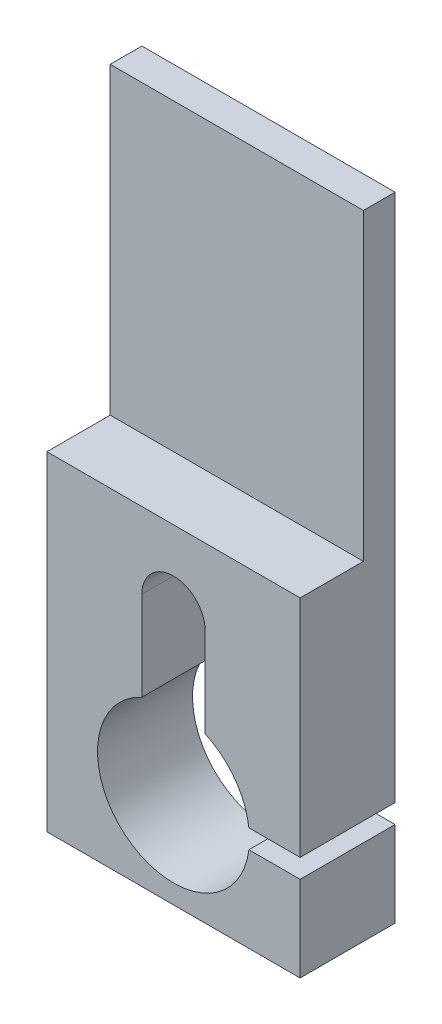
ISO-10303-21;
HEADER;
FILE_DESCRIPTION(('STEP AP214'),'2;1');
FILE_NAME('part.step','',(''),(''),'','','');
FILE_SCHEMA(('AUTOMOTIVE_DESIGN { 1 0 10303 214 1 1 1 1 }'));
ENDSEC;
DATA;
#1=APPLICATION_CONTEXT('core data for automotive mechanical design processes');
#2=APPLICATION_PROTOCOL_DEFINITION('international standard','automotive_design',2000,#1);
#3=PRODUCT_CONTEXT('',#1,'mechanical');
#4=PRODUCT('Part','Part','',(#3));
#5=PRODUCT_RELATED_PRODUCT_CATEGORY('part','',(#4));
#6=PRODUCT_DEFINITION_FORMATION('','',#4);
#7=PRODUCT_DEFINITION_CONTEXT('part definition',#1,'design');
#8=PRODUCT_DEFINITION('design','',#6,#7);
#9=PRODUCT_DEFINITION_SHAPE('','',#8);
#10=(LENGTH_UNIT() NAMED_UNIT(*) SI_UNIT(.MILLI.,.METRE.));
#11=(NAMED_UNIT(*) PLANE_ANGLE_UNIT() SI_UNIT($,.RADIAN.));
#12=(NAMED_UNIT(*) SI_UNIT($,.STERADIAN.) SOLID_ANGLE_UNIT());
#13=UNCERTAINTY_MEASURE_WITH_UNIT(LENGTH_MEASURE(1.E-05),#10,'distance_accuracy_value','');
#14=(GEOMETRIC_REPRESENTATION_CONTEXT(3) GLOBAL_UNCERTAINTY_ASSIGNED_CONTEXT((#13)) GLOBAL_UNIT_ASSIGNED_CONTEXT((#10,
#11,#12)) REPRESENTATION_CONTEXT('',''));
#15=CARTESIAN_POINT('',(0.,0.,0.));
#16=DIRECTION('',(0.,0.,1.));
#17=DIRECTION('',(1.,0.,0.));
#18=AXIS2_PLACEMENT_3D('',#15,#16,#17);
#19=CARTESIAN_POINT('',(0.,0.,15.));
#20=DIRECTION('',(-1.,0.,0.));
#21=DIRECTION('',(0.,0.,1.));
#22=AXIS2_PLACEMENT_3D('',#19,#20,#21);
#23=PLANE('',#22);
#24=DIRECTION('',(0.,1.,0.));
#25=VECTOR('',#24,1.);
#26=CARTESIAN_POINT('',(0.,0.,0.));
#27=LINE('',#26,#25);
#28=CARTESIAN_POINT('',(0.,0.,0.));
#29=VERTEX_POINT('',#28);
#30=CARTESIAN_POINT('',(0.,13.5,0.));
#31=VERTEX_POINT('',#30);
#32=EDGE_CURVE('E164',#29,#31,#27,.T.);
#33=ORIENTED_EDGE('',*,*,#32,.T.);
#34=DIRECTION('',(0.,0.,-1.));
#35=VECTOR('',#34,1.);
#36=CARTESIAN_POINT('',(0.,13.5,15.));
#37=LINE('',#36,#35);
#38=CARTESIAN_POINT('',(0.,13.5,15.));
#39=VERTEX_POINT('',#38);
#40=EDGE_CURVE('E11',#39,#31,#37,.T.);
#41=ORIENTED_EDGE('',*,*,#40,.F.);
#42=DIRECTION('',(0.,1.,0.));
#43=VECTOR('',#42,1.);
#44=CARTESIAN_POINT('',(0.,0.,15.));
#45=LINE('',#44,#43);
#46=CARTESIAN_POINT('',(0.,0.,15.));
#47=VERTEX_POINT('',#46);
#48=EDGE_CURVE('E188',#47,#39,#45,.T.);
#49=ORIENTED_EDGE('',*,*,#48,.F.);
#50=DIRECTION('',(0.,0.,-1.));
#51=VECTOR('',#50,1.);
#52=CARTESIAN_POINT('',(0.,0.,15.));
#53=LINE('',#52,#51);
#54=EDGE_CURVE('E163',#47,#29,#53,.T.);
#55=ORIENTED_EDGE('',*,*,#54,.T.);
#56=EDGE_LOOP('',(#33,#41,#49,#55));
#57=FACE_BOUND('',#56,.T.);
#58=ADVANCED_FACE('F31',(#57),#23,.F.);
#59=CARTESIAN_POINT('',(-8.09411910020934,13.5,15.));
#60=DIRECTION('',(0.,-1.,0.));
#61=DIRECTION('',(0.,0.,-1.));
#62=AXIS2_PLACEMENT_3D('',#59,#60,#61);
#63=PLANE('',#62);
#64=DIRECTION('',(-1.,0.,0.));
#65=VECTOR('',#64,1.);
#66=CARTESIAN_POINT('',(-8.09411910020934,13.5,0.));
#67=LINE('',#66,#65);
#68=CARTESIAN_POINT('',(-8.09411910020934,13.5,0.));
#69=VERTEX_POINT('',#68);
#70=EDGE_CURVE('E167',#31,#69,#67,.T.);
#71=ORIENTED_EDGE('',*,*,#70,.T.);
#72=DIRECTION('',(0.,0.,-1.));
#73=VECTOR('',#72,1.);
#74=CARTESIAN_POINT('',(-8.09411910020934,13.5,15.));
#75=LINE('',#74,#73);
#76=CARTESIAN_POINT('',(-8.09411910020934,13.5,15.));
#77=VERTEX_POINT('',#76);
#78=EDGE_CURVE('E38',#77,#69,#75,.T.);
#79=ORIENTED_EDGE('',*,*,#78,.F.);
#80=DIRECTION('',(-1.,0.,0.));
#81=VECTOR('',#80,1.);
#82=CARTESIAN_POINT('',(-8.09411910020934,13.5,15.));
#83=LINE('',#82,#81);
#84=EDGE_CURVE('E107',#39,#77,#83,.T.);
#85=ORIENTED_EDGE('',*,*,#84,.F.);
#86=ORIENTED_EDGE('',*,*,#40,.T.);
#87=EDGE_LOOP('',(#71,#79,#85,#86));
#88=FACE_BOUND('',#87,.T.);
#89=ADVANCED_FACE('F279',(#88),#63,.F.);
#90=CARTESIAN_POINT('',(-20.,15.,15.));
#91=DIRECTION('',(0.,0.,-1.));
#92=DIRECTION('',(-1.,0.,0.));
#93=AXIS2_PLACEMENT_3D('',#90,#91,#92);
#94=CYLINDRICAL_SURFACE('',#93,12.);
#95=CARTESIAN_POINT('',(-20.,15.,0.));
#96=DIRECTION('',(0.,0.,-1.));
#97=DIRECTION('',(1.,0.,0.));
#98=AXIS2_PLACEMENT_3D('',#95,#96,#97);
#99=CIRCLE('',#98,12.);
#100=CARTESIAN_POINT('',(-25.,25.9087121146357,0.));
#101=VERTEX_POINT('',#100);
#102=EDGE_CURVE('E169',#69,#101,#99,.T.);
#103=ORIENTED_EDGE('',*,*,#102,.T.);
#104=DIRECTION('',(0.,0.,-1.));
#105=VECTOR('',#104,1.);
#106=CARTESIAN_POINT('',(-25.,25.9087121146357,15.));
#107=LINE('',#106,#105);
#108=CARTESIAN_POINT('',(-25.,25.9087121146357,15.));
#109=VERTEX_POINT('',#108);
#110=EDGE_CURVE('E205',#109,#101,#107,.T.);
#111=ORIENTED_EDGE('',*,*,#110,.F.);
#112=CARTESIAN_POINT('',(-20.,15.,15.));
#113=DIRECTION('',(0.,0.,-1.));
#114=DIRECTION('',(1.,0.,0.));
#115=AXIS2_PLACEMENT_3D('',#112,#113,#114);
#116=CIRCLE('',#115,12.);
#117=EDGE_CURVE('E213',#77,#109,#116,.T.);
#118=ORIENTED_EDGE('',*,*,#117,.F.);
#119=ORIENTED_EDGE('',*,*,#78,.T.);
#120=EDGE_LOOP('',(#103,#111,#118,#119));
#121=FACE_BOUND('',#120,.T.);
#122=ADVANCED_FACE('F211',(#121),#94,.F.);
#123=CARTESIAN_POINT('',(-25.,25.9087121146357,15.));
#124=DIRECTION('',(-1.,0.,0.));
#125=DIRECTION('',(0.,0.,1.));
#126=AXIS2_PLACEMENT_3D('',#123,#124,#125);
#127=PLANE('',#126);
#128=DIRECTION('',(0.,1.,0.));
#129=VECTOR('',#128,1.);
#130=CARTESIAN_POINT('',(-25.,25.9087121146357,0.));
#131=LINE('',#130,#129);
#132=CARTESIAN_POINT('',(-25.,40.,0.));
#133=VERTEX_POINT('',#132);
#134=EDGE_CURVE('E171',#101,#133,#131,.T.);
#135=ORIENTED_EDGE('',*,*,#134,.T.);
#136=DIRECTION('',(0.,0.,-1.));
#137=VECTOR('',#136,1.);
#138=CARTESIAN_POINT('',(-25.,40.,15.));
#139=LINE('',#138,#137);
#140=CARTESIAN_POINT('',(-25.,40.,15.));
#141=VERTEX_POINT('',#140);
#142=EDGE_CURVE('E202',#141,#133,#139,.T.);
#143=ORIENTED_EDGE('',*,*,#142,.F.);
#144=DIRECTION('',(0.,1.,0.));
#145=VECTOR('',#144,1.);
#146=CARTESIAN_POINT('',(-25.,25.9087121146357,15.));
#147=LINE('',#146,#145);
#148=EDGE_CURVE('E231',#109,#141,#147,.T.);
#149=ORIENTED_EDGE('',*,*,#148,.F.);
#150=ORIENTED_EDGE('',*,*,#110,.T.);
#151=EDGE_LOOP('',(#135,#143,#149,#150));
#152=FACE_BOUND('',#151,.T.);
#153=ADVANCED_FACE('F222',(#152),#127,.F.);
#154=CARTESIAN_POINT('',(-20.,40.,15.));
#155=DIRECTION('',(0.,0.,-1.));
#156=DIRECTION('',(-1.,0.,0.));
#157=AXIS2_PLACEMENT_3D('',#154,#155,#156);
#158=CYLINDRICAL_SURFACE('',#157,5.);
#159=CARTESIAN_POINT('',(-20.,40.,0.));
#160=DIRECTION('',(0.,0.,-1.));
#161=DIRECTION('',(1.,0.,0.));
#162=AXIS2_PLACEMENT_3D('',#159,#160,#161);
#163=CIRCLE('',#162,5.);
#164=CARTESIAN_POINT('',(-15.,40.,0.));
#165=VERTEX_POINT('',#164);
#166=EDGE_CURVE('E173',#133,#165,#163,.T.);
#167=ORIENTED_EDGE('',*,*,#166,.T.);
#168=DIRECTION('',(0.,0.,-1.));
#169=VECTOR('',#168,1.);
#170=CARTESIAN_POINT('',(-15.,40.,15.));
#171=LINE('',#170,#169);
#172=CARTESIAN_POINT('',(-15.,40.,15.));
#173=VERTEX_POINT('',#172);
#174=EDGE_CURVE('E199',#173,#165,#171,.T.);
#175=ORIENTED_EDGE('',*,*,#174,.F.);
#176=CARTESIAN_POINT('',(-20.,40.,15.));
#177=DIRECTION('',(0.,0.,-1.));
#178=DIRECTION('',(1.,0.,0.));
#179=AXIS2_PLACEMENT_3D('',#176,#177,#178);
#180=CIRCLE('',#179,5.);
#181=EDGE_CURVE('E228',#141,#173,#180,.T.);
#182=ORIENTED_EDGE('',*,*,#181,.F.);
#183=ORIENTED_EDGE('',*,*,#142,.T.);
#184=EDGE_LOOP('',(#167,#175,#182,#183));
#185=FACE_BOUND('',#184,.T.);
#186=ADVANCED_FACE('F226',(#185),#158,.F.);
#187=CARTESIAN_POINT('',(-15.,25.9087121146357,15.));
#188=DIRECTION('',(1.,0.,0.));
#189=DIRECTION('',(0.,0.,-1.));
#190=AXIS2_PLACEMENT_3D('',#187,#188,#189);
#191=PLANE('',#190);
#192=DIRECTION('',(0.,-1.,0.));
#193=VECTOR('',#192,1.);
#194=CARTESIAN_POINT('',(-15.,25.9087121146357,0.));
#195=LINE('',#194,#193);
#196=CARTESIAN_POINT('',(-15.,25.9087121146357,0.));
#197=VERTEX_POINT('',#196);
#198=EDGE_CURVE('E175',#165,#197,#195,.T.);
#199=ORIENTED_EDGE('',*,*,#198,.T.);
#200=DIRECTION('',(0.,0.,-1.));
#201=VECTOR('',#200,1.);
#202=CARTESIAN_POINT('',(-15.,25.9087121146357,15.));
#203=LINE('',#202,#201);
#204=CARTESIAN_POINT('',(-15.,25.9087121146357,15.));
#205=VERTEX_POINT('',#204);
#206=EDGE_CURVE('E196',#205,#197,#203,.T.);
#207=ORIENTED_EDGE('',*,*,#206,.F.);
#208=DIRECTION('',(0.,-1.,0.));
#209=VECTOR('',#208,1.);
#210=CARTESIAN_POINT('',(-15.,25.9087121146357,15.));
#211=LINE('',#210,#209);
#212=EDGE_CURVE('E230',#173,#205,#211,.T.);
#213=ORIENTED_EDGE('',*,*,#212,.F.);
#214=ORIENTED_EDGE('',*,*,#174,.T.);
#215=EDGE_LOOP('',(#199,#207,#213,#214));
#216=FACE_BOUND('',#215,.T.);
#217=ADVANCED_FACE('F291',(#216),#191,.F.);
#218=CARTESIAN_POINT('',(-20.,15.,15.));
#219=DIRECTION('',(0.,0.,-1.));
#220=DIRECTION('',(-1.,0.,0.));
#221=AXIS2_PLACEMENT_3D('',#218,#219,#220);
#222=CYLINDRICAL_SURFACE('',#221,12.);
#223=CARTESIAN_POINT('',(-20.,15.,0.));
#224=DIRECTION('',(0.,0.,-1.));
#225=DIRECTION('',(1.,0.,0.));
#226=AXIS2_PLACEMENT_3D('',#223,#224,#225);
#227=CIRCLE('',#226,12.);
#228=CARTESIAN_POINT('',(-8.09411910020934,16.5,0.));
#229=VERTEX_POINT('',#228);
#230=EDGE_CURVE('E177',#197,#229,#227,.T.);
#231=ORIENTED_EDGE('',*,*,#230,.T.);
#232=DIRECTION('',(0.,0.,-1.));
#233=VECTOR('',#232,1.);
#234=CARTESIAN_POINT('',(-8.09411910020934,16.5,15.));
#235=LINE('',#234,#233);
#236=CARTESIAN_POINT('',(-8.09411910020934,16.5,15.));
#237=VERTEX_POINT('',#236);
#238=EDGE_CURVE('E149',#237,#229,#235,.T.);
#239=ORIENTED_EDGE('',*,*,#238,.F.);
#240=CARTESIAN_POINT('',(-20.,15.,15.));
#241=DIRECTION('',(0.,0.,-1.));
#242=DIRECTION('',(1.,0.,0.));
#243=AXIS2_PLACEMENT_3D('',#240,#241,#242);
#244=CIRCLE('',#243,12.);
#245=EDGE_CURVE('E136',#205,#237,#244,.T.);
#246=ORIENTED_EDGE('',*,*,#245,.F.);
#247=ORIENTED_EDGE('',*,*,#206,.T.);
#248=EDGE_LOOP('',(#231,#239,#246,#247));
#249=FACE_BOUND('',#248,.T.);
#250=ADVANCED_FACE('F294',(#249),#222,.F.);
#251=CARTESIAN_POINT('',(-8.09411910020934,16.5,15.));
#252=DIRECTION('',(0.,1.,0.));
#253=DIRECTION('',(0.,0.,1.));
#254=AXIS2_PLACEMENT_3D('',#251,#252,#253);
#255=PLANE('',#254);
#256=DIRECTION('',(1.,0.,0.));
#257=VECTOR('',#256,1.);
#258=CARTESIAN_POINT('',(-8.09411910020934,16.5,0.));
#259=LINE('',#258,#257);
#260=CARTESIAN_POINT('',(0.,16.5,0.));
#261=VERTEX_POINT('',#260);
#262=EDGE_CURVE('E145',#229,#261,#259,.T.);
#263=ORIENTED_EDGE('',*,*,#262,.T.);
#264=DIRECTION('',(0.,0.,-1.));
#265=VECTOR('',#264,1.);
#266=CARTESIAN_POINT('',(0.,16.5,15.));
#267=LINE('',#266,#265);
#268=CARTESIAN_POINT('',(0.,16.5,15.));
#269=VERTEX_POINT('',#268);
#270=EDGE_CURVE('E142',#269,#261,#267,.T.);
#271=ORIENTED_EDGE('',*,*,#270,.F.);
#272=DIRECTION('',(1.,0.,0.));
#273=VECTOR('',#272,1.);
#274=CARTESIAN_POINT('',(-8.09411910020934,16.5,15.));
#275=LINE('',#274,#273);
#276=EDGE_CURVE('E130',#237,#269,#275,.T.);
#277=ORIENTED_EDGE('',*,*,#276,.F.);
#278=ORIENTED_EDGE('',*,*,#238,.T.);
#279=EDGE_LOOP('',(#263,#271,#277,#278));
#280=FACE_BOUND('',#279,.T.);
#281=ADVANCED_FACE('F143',(#280),#255,.F.);
#282=CARTESIAN_POINT('',(0.,16.5,15.));
#283=DIRECTION('',(-1.,0.,0.));
#284=DIRECTION('',(0.,0.,1.));
#285=AXIS2_PLACEMENT_3D('',#282,#283,#284);
#286=PLANE('',#285);
#287=DIRECTION('',(0.,1.,0.));
#288=VECTOR('',#287,1.);
#289=CARTESIAN_POINT('',(0.,100.,5.));
#290=LINE('',#289,#288);
#291=CARTESIAN_POINT('',(0.,52.,5.));
#292=VERTEX_POINT('',#291);
#293=CARTESIAN_POINT('',(0.,100.,5.));
#294=VERTEX_POINT('',#293);
#295=EDGE_CURVE('E247',#292,#294,#290,.T.);
#296=ORIENTED_EDGE('',*,*,#295,.F.);
#297=DIRECTION('',(0.,0.,1.));
#298=VECTOR('',#297,1.);
#299=CARTESIAN_POINT('',(0.,52.,5.));
#300=LINE('',#299,#298);
#301=CARTESIAN_POINT('',(0.,52.,15.));
#302=VERTEX_POINT('',#301);
#303=EDGE_CURVE('E156',#292,#302,#300,.T.);
#304=ORIENTED_EDGE('',*,*,#303,.T.);
#305=DIRECTION('',(0.,1.,0.));
#306=VECTOR('',#305,1.);
#307=CARTESIAN_POINT('',(0.,16.5,15.));
#308=LINE('',#307,#306);
#309=EDGE_CURVE('E134',#269,#302,#308,.T.);
#310=ORIENTED_EDGE('',*,*,#309,.F.);
#311=ORIENTED_EDGE('',*,*,#270,.T.);
#312=DIRECTION('',(0.,1.,0.));
#313=VECTOR('',#312,1.);
#314=CARTESIAN_POINT('',(0.,16.5,0.));
#315=LINE('',#314,#313);
#316=CARTESIAN_POINT('',(0.,100.,0.));
#317=VERTEX_POINT('',#316);
#318=EDGE_CURVE('E180',#261,#317,#315,.T.);
#319=ORIENTED_EDGE('',*,*,#318,.T.);
#320=DIRECTION('',(0.,0.,-1.));
#321=VECTOR('',#320,1.);
#322=CARTESIAN_POINT('',(0.,100.,15.));
#323=LINE('',#322,#321);
#324=EDGE_CURVE('E150',#294,#317,#323,.T.);
#325=ORIENTED_EDGE('',*,*,#324,.F.);
#326=EDGE_LOOP('',(#296,#304,#310,#311,#319,#325));
#327=FACE_BOUND('',#326,.T.);
#328=ADVANCED_FACE('F154',(#327),#286,.F.);
#329=CARTESIAN_POINT('',(-40.,100.,15.));
#330=DIRECTION('',(0.,-1.,0.));
#331=DIRECTION('',(0.,0.,-1.));
#332=AXIS2_PLACEMENT_3D('',#329,#330,#331);
#333=PLANE('',#332);
#334=DIRECTION('',(0.,0.,-1.));
#335=VECTOR('',#334,1.);
#336=CARTESIAN_POINT('',(-40.,100.,15.));
#337=LINE('',#336,#335);
#338=CARTESIAN_POINT('',(-40.,100.,5.));
#339=VERTEX_POINT('',#338);
#340=CARTESIAN_POINT('',(-40.,100.,0.));
#341=VERTEX_POINT('',#340);
#342=EDGE_CURVE('E192',#339,#341,#337,.T.);
#343=ORIENTED_EDGE('',*,*,#342,.F.);
#344=DIRECTION('',(-1.,0.,0.));
#345=VECTOR('',#344,1.);
#346=CARTESIAN_POINT('',(-40.,100.,5.));
#347=LINE('',#346,#345);
#348=EDGE_CURVE('E240',#294,#339,#347,.T.);
#349=ORIENTED_EDGE('',*,*,#348,.F.);
#350=ORIENTED_EDGE('',*,*,#324,.T.);
#351=DIRECTION('',(-1.,0.,0.));
#352=VECTOR('',#351,1.);
#353=CARTESIAN_POINT('',(-40.,100.,0.));
#354=LINE('',#353,#352);
#355=EDGE_CURVE('E182',#317,#341,#354,.T.);
#356=ORIENTED_EDGE('',*,*,#355,.T.);
#357=EDGE_LOOP('',(#343,#349,#350,#356));
#358=FACE_BOUND('',#357,.T.);
#359=ADVANCED_FACE('F272',(#358),#333,.F.);
#360=CARTESIAN_POINT('',(-40.,0.,15.));
#361=DIRECTION('',(1.,0.,0.));
#362=DIRECTION('',(0.,0.,-1.));
#363=AXIS2_PLACEMENT_3D('',#360,#361,#362);
#364=PLANE('',#363);
#365=DIRECTION('',(0.,-1.,0.));
#366=VECTOR('',#365,1.);
#367=CARTESIAN_POINT('',(-40.,0.,15.));
#368=LINE('',#367,#366);
#369=CARTESIAN_POINT('',(-40.,52.,15.));
#370=VERTEX_POINT('',#369);
#371=CARTESIAN_POINT('',(-40.,0.,15.));
#372=VERTEX_POINT('',#371);
#373=EDGE_CURVE('E157',#370,#372,#368,.T.);
#374=ORIENTED_EDGE('',*,*,#373,.F.);
#375=DIRECTION('',(0.,0.,1.));
#376=VECTOR('',#375,1.);
#377=CARTESIAN_POINT('',(-40.,52.,5.));
#378=LINE('',#377,#376);
#379=CARTESIAN_POINT('',(-40.,52.,5.));
#380=VERTEX_POINT('',#379);
#381=EDGE_CURVE('E45',#380,#370,#378,.T.);
#382=ORIENTED_EDGE('',*,*,#381,.F.);
#383=DIRECTION('',(0.,-1.,0.));
#384=VECTOR('',#383,1.);
#385=CARTESIAN_POINT('',(-40.,52.,5.));
#386=LINE('',#385,#384);
#387=EDGE_CURVE('E244',#339,#380,#386,.T.);
#388=ORIENTED_EDGE('',*,*,#387,.F.);
#389=ORIENTED_EDGE('',*,*,#342,.T.);
#390=DIRECTION('',(0.,-1.,0.));
#391=VECTOR('',#390,1.);
#392=CARTESIAN_POINT('',(-40.,0.,0.));
#393=LINE('',#392,#391);
#394=CARTESIAN_POINT('',(-40.,0.,0.));
#395=VERTEX_POINT('',#394);
#396=EDGE_CURVE('E185',#341,#395,#393,.T.);
#397=ORIENTED_EDGE('',*,*,#396,.T.);
#398=DIRECTION('',(0.,0.,-1.));
#399=VECTOR('',#398,1.);
#400=CARTESIAN_POINT('',(-40.,0.,15.));
#401=LINE('',#400,#399);
#402=EDGE_CURVE('E190',#372,#395,#401,.T.);
#403=ORIENTED_EDGE('',*,*,#402,.F.);
#404=EDGE_LOOP('',(#374,#382,#388,#389,#397,#403));
#405=FACE_BOUND('',#404,.T.);
#406=ADVANCED_FACE('F264',(#405),#364,.F.);
#407=CARTESIAN_POINT('',(0.,0.,15.));
#408=DIRECTION('',(0.,1.,0.));
#409=DIRECTION('',(-1.,0.,0.));
#410=AXIS2_PLACEMENT_3D('',#407,#408,#409);
#411=PLANE('',#410);
#412=DIRECTION('',(1.,0.,0.));
#413=VECTOR('',#412,1.);
#414=CARTESIAN_POINT('',(0.,0.,0.));
#415=LINE('',#414,#413);
#416=EDGE_CURVE('E99',#395,#29,#415,.T.);
#417=ORIENTED_EDGE('',*,*,#416,.T.);
#418=ORIENTED_EDGE('',*,*,#54,.F.);
#419=DIRECTION('',(1.,0.,0.));
#420=VECTOR('',#419,1.);
#421=CARTESIAN_POINT('',(0.,0.,15.));
#422=LINE('',#421,#420);
#423=EDGE_CURVE('E54',#372,#47,#422,.T.);
#424=ORIENTED_EDGE('',*,*,#423,.F.);
#425=ORIENTED_EDGE('',*,*,#402,.T.);
#426=EDGE_LOOP('',(#417,#418,#424,#425));
#427=FACE_BOUND('',#426,.T.);
#428=ADVANCED_FACE('F275',(#427),#411,.F.);
#429=CARTESIAN_POINT('',(-20.,15.,15.));
#430=DIRECTION('',(0.,0.,1.));
#431=DIRECTION('',(1.,0.,0.));
#432=AXIS2_PLACEMENT_3D('',#429,#430,#431);
#433=PLANE('',#432);
#434=DIRECTION('',(1.,0.,0.));
#435=VECTOR('',#434,1.);
#436=CARTESIAN_POINT('',(0.,52.,15.));
#437=LINE('',#436,#435);
#438=EDGE_CURVE('E242',#370,#302,#437,.T.);
#439=ORIENTED_EDGE('',*,*,#438,.F.);
#440=ORIENTED_EDGE('',*,*,#373,.T.);
#441=ORIENTED_EDGE('',*,*,#423,.T.);
#442=ORIENTED_EDGE('',*,*,#48,.T.);
#443=ORIENTED_EDGE('',*,*,#84,.T.);
#444=ORIENTED_EDGE('',*,*,#117,.T.);
#445=ORIENTED_EDGE('',*,*,#148,.T.);
#446=ORIENTED_EDGE('',*,*,#181,.T.);
#447=ORIENTED_EDGE('',*,*,#212,.T.);
#448=ORIENTED_EDGE('',*,*,#245,.T.);
#449=ORIENTED_EDGE('',*,*,#276,.T.);
#450=ORIENTED_EDGE('',*,*,#309,.T.);
#451=EDGE_LOOP('',(#439,#440,#441,#442,#443,#444,#445,#446,#447,#448,#449,#450));
#452=FACE_BOUND('',#451,.T.);
#453=ADVANCED_FACE('F132',(#452),#433,.T.);
#454=CARTESIAN_POINT('',(-20.,15.,0.));
#455=DIRECTION('',(0.,0.,1.));
#456=DIRECTION('',(1.,0.,0.));
#457=AXIS2_PLACEMENT_3D('',#454,#455,#456);
#458=PLANE('',#457);
#459=ORIENTED_EDGE('',*,*,#32,.F.);
#460=ORIENTED_EDGE('',*,*,#416,.F.);
#461=ORIENTED_EDGE('',*,*,#396,.F.);
#462=ORIENTED_EDGE('',*,*,#355,.F.);
#463=ORIENTED_EDGE('',*,*,#318,.F.);
#464=ORIENTED_EDGE('',*,*,#262,.F.);
#465=ORIENTED_EDGE('',*,*,#230,.F.);
#466=ORIENTED_EDGE('',*,*,#198,.F.);
#467=ORIENTED_EDGE('',*,*,#166,.F.);
#468=ORIENTED_EDGE('',*,*,#134,.F.);
#469=ORIENTED_EDGE('',*,*,#102,.F.);
#470=ORIENTED_EDGE('',*,*,#70,.F.);
#471=EDGE_LOOP('',(#459,#460,#461,#462,#463,#464,#465,#466,#467,#468,#469,#470));
#472=FACE_BOUND('',#471,.T.);
#473=ADVANCED_FACE('F217',(#472),#458,.F.);
#474=CARTESIAN_POINT('',(0.,52.,5.));
#475=DIRECTION('',(0.,-1.,0.));
#476=DIRECTION('',(0.,0.,-1.));
#477=AXIS2_PLACEMENT_3D('',#474,#475,#476);
#478=PLANE('',#477);
#479=ORIENTED_EDGE('',*,*,#438,.T.);
#480=ORIENTED_EDGE('',*,*,#303,.F.);
#481=DIRECTION('',(1.,0.,0.));
#482=VECTOR('',#481,1.);
#483=CARTESIAN_POINT('',(0.,52.,5.));
#484=LINE('',#483,#482);
#485=EDGE_CURVE('E250',#380,#292,#484,.T.);
#486=ORIENTED_EDGE('',*,*,#485,.F.);
#487=ORIENTED_EDGE('',*,*,#381,.T.);
#488=EDGE_LOOP('',(#479,#480,#486,#487));
#489=FACE_BOUND('',#488,.T.);
#490=ADVANCED_FACE('F266',(#489),#478,.F.);
#491=CARTESIAN_POINT('',(-40.,100.,5.));
#492=DIRECTION('',(0.,0.,-1.));
#493=DIRECTION('',(-1.,0.,0.));
#494=AXIS2_PLACEMENT_3D('',#491,#492,#493);
#495=PLANE('',#494);
#496=ORIENTED_EDGE('',*,*,#387,.T.);
#497=ORIENTED_EDGE('',*,*,#485,.T.);
#498=ORIENTED_EDGE('',*,*,#295,.T.);
#499=ORIENTED_EDGE('',*,*,#348,.T.);
#500=EDGE_LOOP('',(#496,#497,#498,#499));
#501=FACE_BOUND('',#500,.T.);
#502=ADVANCED_FACE('F257',(#501),#495,.F.);
#503=CLOSED_SHELL('',(#58,#89,#122,#153,#186,#217,#250,#281,#328,#359,#406,#428,#453,#473,#490,#502));
#504=MANIFOLD_SOLID_BREP('B2',#503);
#505=ADVANCED_BREP_SHAPE_REPRESENTATION('',(#18,#504),#14);
#506=SHAPE_DEFINITION_REPRESENTATION(#9,#505);
ENDSEC;
END-ISO-10303-21;
